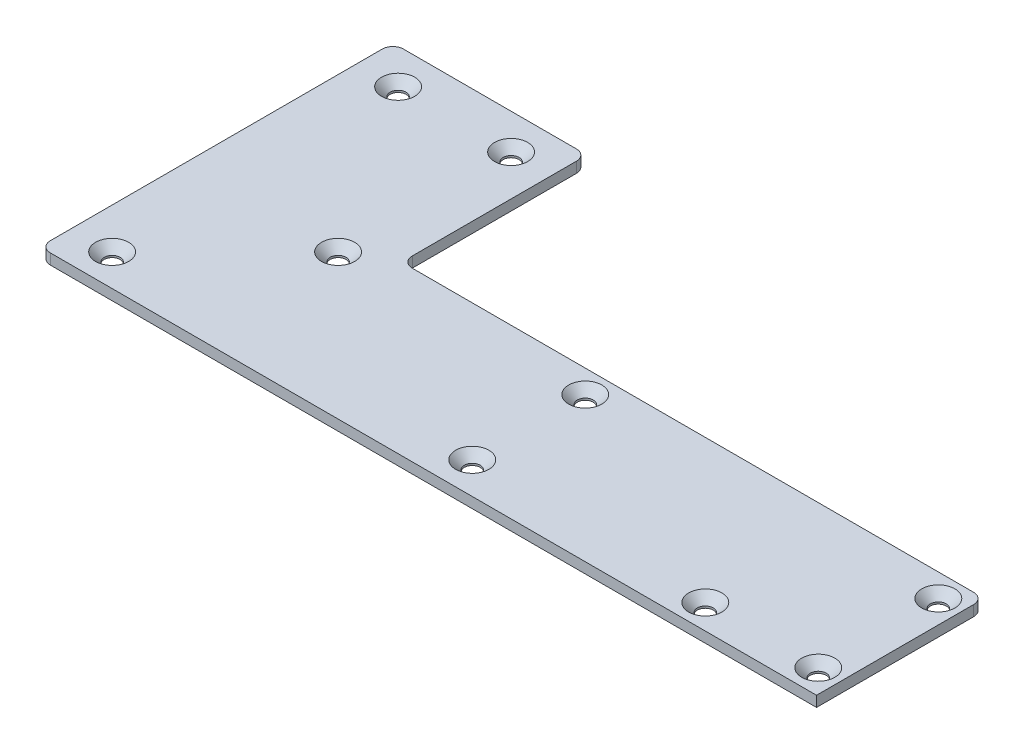
ISO-10303-21;
HEADER;
FILE_DESCRIPTION(('STEP AP214'),'2;1');
FILE_NAME('part.step','',(''),(''),'','','');
FILE_SCHEMA(('AUTOMOTIVE_DESIGN { 1 0 10303 214 1 1 1 1 }'));
ENDSEC;
DATA;
#1=APPLICATION_CONTEXT('core data for automotive mechanical design processes');
#2=APPLICATION_PROTOCOL_DEFINITION('international standard','automotive_design',2000,#1);
#3=PRODUCT_CONTEXT('',#1,'mechanical');
#4=PRODUCT('Part','Part','',(#3));
#5=PRODUCT_RELATED_PRODUCT_CATEGORY('part','',(#4));
#6=PRODUCT_DEFINITION_FORMATION('','',#4);
#7=PRODUCT_DEFINITION_CONTEXT('part definition',#1,'design');
#8=PRODUCT_DEFINITION('design','',#6,#7);
#9=PRODUCT_DEFINITION_SHAPE('','',#8);
#10=(LENGTH_UNIT() NAMED_UNIT(*) SI_UNIT(.MILLI.,.METRE.));
#11=(NAMED_UNIT(*) PLANE_ANGLE_UNIT() SI_UNIT($,.RADIAN.));
#12=(NAMED_UNIT(*) SI_UNIT($,.STERADIAN.) SOLID_ANGLE_UNIT());
#13=UNCERTAINTY_MEASURE_WITH_UNIT(LENGTH_MEASURE(1.E-05),#10,'distance_accuracy_value','');
#14=(GEOMETRIC_REPRESENTATION_CONTEXT(3) GLOBAL_UNCERTAINTY_ASSIGNED_CONTEXT((#13)) GLOBAL_UNIT_ASSIGNED_CONTEXT((#10,
#11,#12)) REPRESENTATION_CONTEXT('',''));
#15=CARTESIAN_POINT('',(0.,0.,0.));
#16=DIRECTION('',(0.,0.,1.));
#17=DIRECTION('',(1.,0.,0.));
#18=AXIS2_PLACEMENT_3D('',#15,#16,#17);
#19=CARTESIAN_POINT('',(0.,3.,-100.));
#20=DIRECTION('',(1.,0.,0.));
#21=DIRECTION('',(0.,0.,-1.));
#22=AXIS2_PLACEMENT_3D('',#19,#20,#21);
#23=PLANE('',#22);
#24=DIRECTION('',(0.,0.,1.));
#25=VECTOR('',#24,1.);
#26=CARTESIAN_POINT('',(0.,0.,-100.));
#27=LINE('',#26,#25);
#28=CARTESIAN_POINT('',(0.,0.,-97.));
#29=VERTEX_POINT('',#28);
#30=CARTESIAN_POINT('',(0.,0.,-3.));
#31=VERTEX_POINT('',#30);
#32=EDGE_CURVE('E155',#29,#31,#27,.T.);
#33=ORIENTED_EDGE('',*,*,#32,.T.);
#34=DIRECTION('',(0.,-1.,0.));
#35=VECTOR('',#34,1.);
#36=CARTESIAN_POINT('',(0.,3.,-3.));
#37=LINE('',#36,#35);
#38=CARTESIAN_POINT('',(0.,3.,-3.));
#39=VERTEX_POINT('',#38);
#40=EDGE_CURVE('E194',#31,#39,#37,.F.);
#41=ORIENTED_EDGE('',*,*,#40,.T.);
#42=DIRECTION('',(0.,0.,1.));
#43=VECTOR('',#42,1.);
#44=CARTESIAN_POINT('',(0.,3.,-100.));
#45=LINE('',#44,#43);
#46=CARTESIAN_POINT('',(0.,3.,-97.));
#47=VERTEX_POINT('',#46);
#48=EDGE_CURVE('E130',#47,#39,#45,.T.);
#49=ORIENTED_EDGE('',*,*,#48,.F.);
#50=DIRECTION('',(0.,-1.,0.));
#51=VECTOR('',#50,1.);
#52=CARTESIAN_POINT('',(0.,3.,-97.));
#53=LINE('',#52,#51);
#54=EDGE_CURVE('E191',#47,#29,#53,.T.);
#55=ORIENTED_EDGE('',*,*,#54,.T.);
#56=EDGE_LOOP('',(#33,#41,#49,#55));
#57=FACE_BOUND('',#56,.T.);
#58=ADVANCED_FACE('F35',(#57),#23,.F.);
#59=CARTESIAN_POINT('',(0.,3.,0.));
#60=DIRECTION('',(0.,0.,-1.));
#61=DIRECTION('',(-1.,0.,0.));
#62=AXIS2_PLACEMENT_3D('',#59,#60,#61);
#63=PLANE('',#62);
#64=DIRECTION('',(1.,0.,0.));
#65=VECTOR('',#64,1.);
#66=CARTESIAN_POINT('',(0.,3.,0.));
#67=LINE('',#66,#65);
#68=CARTESIAN_POINT('',(3.,3.,0.));
#69=VERTEX_POINT('',#68);
#70=CARTESIAN_POINT('',(219.999999999998,3.,0.));
#71=VERTEX_POINT('',#70);
#72=EDGE_CURVE('E118',#69,#71,#67,.T.);
#73=ORIENTED_EDGE('',*,*,#72,.F.);
#74=DIRECTION('',(0.,-1.,0.));
#75=VECTOR('',#74,1.);
#76=CARTESIAN_POINT('',(3.,3.,0.));
#77=LINE('',#76,#75);
#78=CARTESIAN_POINT('',(3.,0.,0.));
#79=VERTEX_POINT('',#78);
#80=EDGE_CURVE('E189',#69,#79,#77,.T.);
#81=ORIENTED_EDGE('',*,*,#80,.T.);
#82=DIRECTION('',(1.,0.,0.));
#83=VECTOR('',#82,1.);
#84=CARTESIAN_POINT('',(0.,0.,0.));
#85=LINE('',#84,#83);
#86=CARTESIAN_POINT('',(219.999999999998,0.,0.));
#87=VERTEX_POINT('',#86);
#88=EDGE_CURVE('E136',#79,#87,#85,.T.);
#89=ORIENTED_EDGE('',*,*,#88,.T.);
#90=DIRECTION('',(0.,-1.,0.));
#91=VECTOR('',#90,1.);
#92=CARTESIAN_POINT('',(219.999999999998,3.,0.));
#93=LINE('',#92,#91);
#94=EDGE_CURVE('E133',#71,#87,#93,.T.);
#95=ORIENTED_EDGE('',*,*,#94,.F.);
#96=EDGE_LOOP('',(#73,#81,#89,#95));
#97=FACE_BOUND('',#96,.T.);
#98=ADVANCED_FACE('F134',(#97),#63,.F.);
#99=CARTESIAN_POINT('',(219.999999999998,3.,0.));
#100=DIRECTION('',(-1.,0.,0.));
#101=DIRECTION('',(0.,0.,1.));
#102=AXIS2_PLACEMENT_3D('',#99,#100,#101);
#103=PLANE('',#102);
#104=DIRECTION('',(0.,0.,-1.));
#105=VECTOR('',#104,1.);
#106=CARTESIAN_POINT('',(219.999999999998,0.,0.));
#107=LINE('',#106,#105);
#108=CARTESIAN_POINT('',(219.999999999998,0.,-44.4999999999982));
#109=VERTEX_POINT('',#108);
#110=EDGE_CURVE('E160',#87,#109,#107,.T.);
#111=ORIENTED_EDGE('',*,*,#110,.T.);
#112=DIRECTION('',(0.,-1.,0.));
#113=VECTOR('',#112,1.);
#114=CARTESIAN_POINT('',(219.999999999998,3.,-44.4999999999982));
#115=LINE('',#114,#113);
#116=CARTESIAN_POINT('',(219.999999999998,3.,-44.4999999999982));
#117=VERTEX_POINT('',#116);
#118=EDGE_CURVE('E145',#109,#117,#115,.F.);
#119=ORIENTED_EDGE('',*,*,#118,.T.);
#120=DIRECTION('',(0.,0.,-1.));
#121=VECTOR('',#120,1.);
#122=CARTESIAN_POINT('',(219.999999999998,3.,0.));
#123=LINE('',#122,#121);
#124=EDGE_CURVE('E122',#71,#117,#123,.T.);
#125=ORIENTED_EDGE('',*,*,#124,.F.);
#126=ORIENTED_EDGE('',*,*,#94,.T.);
#127=EDGE_LOOP('',(#111,#119,#125,#126));
#128=FACE_BOUND('',#127,.T.);
#129=ADVANCED_FACE('F143',(#128),#103,.F.);
#130=CARTESIAN_POINT('',(219.999999999998,3.,-47.4999999999982));
#131=DIRECTION('',(0.,0.,1.));
#132=DIRECTION('',(1.,0.,0.));
#133=AXIS2_PLACEMENT_3D('',#130,#131,#132);
#134=PLANE('',#133);
#135=DIRECTION('',(-1.,0.,0.));
#136=VECTOR('',#135,1.);
#137=CARTESIAN_POINT('',(219.999999999998,3.,-47.4999999999982));
#138=LINE('',#137,#136);
#139=CARTESIAN_POINT('',(216.999999999998,3.,-47.4999999999982));
#140=VERTEX_POINT('',#139);
#141=CARTESIAN_POINT('',(58.,3.,-47.4999999999982));
#142=VERTEX_POINT('',#141);
#143=EDGE_CURVE('E146',#140,#142,#138,.T.);
#144=ORIENTED_EDGE('',*,*,#143,.F.);
#145=DIRECTION('',(0.,-1.,0.));
#146=VECTOR('',#145,1.);
#147=CARTESIAN_POINT('',(216.999999999998,3.,-47.4999999999982));
#148=LINE('',#147,#146);
#149=CARTESIAN_POINT('',(216.999999999998,0.,-47.4999999999982));
#150=VERTEX_POINT('',#149);
#151=EDGE_CURVE('E171',#140,#150,#148,.T.);
#152=ORIENTED_EDGE('',*,*,#151,.T.);
#153=DIRECTION('',(-1.,0.,0.));
#154=VECTOR('',#153,1.);
#155=CARTESIAN_POINT('',(219.999999999998,0.,-47.4999999999982));
#156=LINE('',#155,#154);
#157=CARTESIAN_POINT('',(58.,0.,-47.4999999999982));
#158=VERTEX_POINT('',#157);
#159=EDGE_CURVE('E162',#150,#158,#156,.T.);
#160=ORIENTED_EDGE('',*,*,#159,.T.);
#161=DIRECTION('',(0.,-1.,0.));
#162=VECTOR('',#161,1.);
#163=CARTESIAN_POINT('',(58.,3.,-47.4999999999982));
#164=LINE('',#163,#162);
#165=EDGE_CURVE('E140',#158,#142,#164,.F.);
#166=ORIENTED_EDGE('',*,*,#165,.T.);
#167=EDGE_LOOP('',(#144,#152,#160,#166));
#168=FACE_BOUND('',#167,.T.);
#169=ADVANCED_FACE('F213',(#168),#134,.F.);
#170=CARTESIAN_POINT('',(55.,3.,-47.4999999999982));
#171=DIRECTION('',(-1.,0.,0.));
#172=DIRECTION('',(0.,0.,1.));
#173=AXIS2_PLACEMENT_3D('',#170,#171,#172);
#174=PLANE('',#173);
#175=DIRECTION('',(0.,0.,-1.));
#176=VECTOR('',#175,1.);
#177=CARTESIAN_POINT('',(55.,3.,-47.4999999999982));
#178=LINE('',#177,#176);
#179=CARTESIAN_POINT('',(55.,3.,-50.4999999999982));
#180=VERTEX_POINT('',#179);
#181=CARTESIAN_POINT('',(55.,3.,-97.));
#182=VERTEX_POINT('',#181);
#183=EDGE_CURVE('E149',#180,#182,#178,.T.);
#184=ORIENTED_EDGE('',*,*,#183,.F.);
#185=DIRECTION('',(0.,-1.,0.));
#186=VECTOR('',#185,1.);
#187=CARTESIAN_POINT('',(55.,0.,-50.4999999999982));
#188=LINE('',#187,#186);
#189=CARTESIAN_POINT('',(55.,0.,-50.4999999999982));
#190=VERTEX_POINT('',#189);
#191=EDGE_CURVE('E202',#180,#190,#188,.T.);
#192=ORIENTED_EDGE('',*,*,#191,.T.);
#193=DIRECTION('',(0.,0.,-1.));
#194=VECTOR('',#193,1.);
#195=CARTESIAN_POINT('',(55.,0.,-47.4999999999982));
#196=LINE('',#195,#194);
#197=CARTESIAN_POINT('',(55.,0.,-97.));
#198=VERTEX_POINT('',#197);
#199=EDGE_CURVE('E165',#190,#198,#196,.T.);
#200=ORIENTED_EDGE('',*,*,#199,.T.);
#201=DIRECTION('',(0.,-1.,0.));
#202=VECTOR('',#201,1.);
#203=CARTESIAN_POINT('',(55.,3.,-97.));
#204=LINE('',#203,#202);
#205=EDGE_CURVE('E200',#198,#182,#204,.F.);
#206=ORIENTED_EDGE('',*,*,#205,.T.);
#207=EDGE_LOOP('',(#184,#192,#200,#206));
#208=FACE_BOUND('',#207,.T.);
#209=ADVANCED_FACE('F219',(#208),#174,.F.);
#210=CARTESIAN_POINT('',(55.,3.,-100.));
#211=DIRECTION('',(0.,0.,1.));
#212=DIRECTION('',(1.,0.,0.));
#213=AXIS2_PLACEMENT_3D('',#210,#211,#212);
#214=PLANE('',#213);
#215=DIRECTION('',(-1.,0.,0.));
#216=VECTOR('',#215,1.);
#217=CARTESIAN_POINT('',(55.,0.,-100.));
#218=LINE('',#217,#216);
#219=CARTESIAN_POINT('',(52.,0.,-100.));
#220=VERTEX_POINT('',#219);
#221=CARTESIAN_POINT('',(2.99999999999999,0.,-100.));
#222=VERTEX_POINT('',#221);
#223=EDGE_CURVE('E168',#220,#222,#218,.T.);
#224=ORIENTED_EDGE('',*,*,#223,.T.);
#225=DIRECTION('',(0.,-1.,0.));
#226=VECTOR('',#225,1.);
#227=CARTESIAN_POINT('',(2.99999999999999,3.,-100.));
#228=LINE('',#227,#226);
#229=CARTESIAN_POINT('',(2.99999999999999,3.,-100.));
#230=VERTEX_POINT('',#229);
#231=EDGE_CURVE('E50',#222,#230,#228,.F.);
#232=ORIENTED_EDGE('',*,*,#231,.T.);
#233=DIRECTION('',(-1.,0.,0.));
#234=VECTOR('',#233,1.);
#235=CARTESIAN_POINT('',(55.,3.,-100.));
#236=LINE('',#235,#234);
#237=CARTESIAN_POINT('',(52.,3.,-100.));
#238=VERTEX_POINT('',#237);
#239=EDGE_CURVE('E141',#238,#230,#236,.T.);
#240=ORIENTED_EDGE('',*,*,#239,.F.);
#241=DIRECTION('',(0.,-1.,0.));
#242=VECTOR('',#241,1.);
#243=CARTESIAN_POINT('',(52.,3.,-100.));
#244=LINE('',#243,#242);
#245=EDGE_CURVE('E196',#238,#220,#244,.T.);
#246=ORIENTED_EDGE('',*,*,#245,.T.);
#247=EDGE_LOOP('',(#224,#232,#240,#246));
#248=FACE_BOUND('',#247,.T.);
#249=ADVANCED_FACE('F224',(#248),#214,.F.);
#250=CARTESIAN_POINT('',(0.,3.,0.));
#251=DIRECTION('',(0.,1.,0.));
#252=DIRECTION('',(0.,0.,1.));
#253=AXIS2_PLACEMENT_3D('',#250,#251,#252);
#254=PLANE('',#253);
#255=CARTESIAN_POINT('',(11.4999999999993,3.,-89.9999999999987));
#256=DIRECTION('',(0.,1.,0.));
#257=DIRECTION('',(0.,0.,1.));
#258=AXIS2_PLACEMENT_3D('',#255,#256,#257);
#259=CIRCLE('',#258,4.7);
#260=CARTESIAN_POINT('',(11.4999999999993,3.,-85.2999999999987));
#261=VERTEX_POINT('',#260);
#262=EDGE_CURVE('E311',#261,#261,#259,.T.);
#263=ORIENTED_EDGE('',*,*,#262,.F.);
#264=EDGE_LOOP('',(#263));
#265=FACE_BOUND('',#264,.T.);
#266=CARTESIAN_POINT('',(11.4999999999985,3.,-8.99999999999867));
#267=DIRECTION('',(0.,1.,0.));
#268=DIRECTION('',(0.,0.,1.));
#269=AXIS2_PLACEMENT_3D('',#266,#267,#268);
#270=CIRCLE('',#269,4.7);
#271=CARTESIAN_POINT('',(11.4999999999985,3.,-4.29999999999868));
#272=VERTEX_POINT('',#271);
#273=EDGE_CURVE('E302',#272,#272,#270,.T.);
#274=ORIENTED_EDGE('',*,*,#273,.F.);
#275=EDGE_LOOP('',(#274));
#276=FACE_BOUND('',#275,.T.);
#277=CARTESIAN_POINT('',(43.4999999999988,3.,-40.9999999999983));
#278=DIRECTION('',(0.,1.,0.));
#279=DIRECTION('',(0.,0.,1.));
#280=AXIS2_PLACEMENT_3D('',#277,#278,#279);
#281=CIRCLE('',#280,4.7);
#282=CARTESIAN_POINT('',(43.4999999999988,3.,-36.2999999999983));
#283=VERTEX_POINT('',#282);
#284=EDGE_CURVE('E293',#283,#283,#281,.T.);
#285=ORIENTED_EDGE('',*,*,#284,.F.);
#286=EDGE_LOOP('',(#285));
#287=FACE_BOUND('',#286,.T.);
#288=CARTESIAN_POINT('',(43.4999999999993,3.,-89.9999999999983));
#289=DIRECTION('',(0.,1.,0.));
#290=DIRECTION('',(0.,0.,1.));
#291=AXIS2_PLACEMENT_3D('',#288,#289,#290);
#292=CIRCLE('',#291,4.7);
#293=CARTESIAN_POINT('',(43.4999999999993,3.,-85.2999999999983));
#294=VERTEX_POINT('',#293);
#295=EDGE_CURVE('E284',#294,#294,#292,.T.);
#296=ORIENTED_EDGE('',*,*,#295,.F.);
#297=EDGE_LOOP('',(#296));
#298=FACE_BOUND('',#297,.T.);
#299=CARTESIAN_POINT('',(113.499999999999,3.,-40.9999999999976));
#300=DIRECTION('',(0.,1.,0.));
#301=DIRECTION('',(0.,0.,1.));
#302=AXIS2_PLACEMENT_3D('',#299,#300,#301);
#303=CIRCLE('',#302,4.7);
#304=CARTESIAN_POINT('',(113.499999999999,3.,-36.2999999999976));
#305=VERTEX_POINT('',#304);
#306=EDGE_CURVE('E275',#305,#305,#303,.T.);
#307=ORIENTED_EDGE('',*,*,#306,.F.);
#308=EDGE_LOOP('',(#307));
#309=FACE_BOUND('',#308,.T.);
#310=CARTESIAN_POINT('',(113.499999999999,3.,-8.99999999999762));
#311=DIRECTION('',(0.,1.,0.));
#312=DIRECTION('',(0.,0.,1.));
#313=AXIS2_PLACEMENT_3D('',#310,#311,#312);
#314=CIRCLE('',#313,4.7);
#315=CARTESIAN_POINT('',(113.499999999999,3.,-4.29999999999762));
#316=VERTEX_POINT('',#315);
#317=EDGE_CURVE('E266',#316,#316,#314,.T.);
#318=ORIENTED_EDGE('',*,*,#317,.F.);
#319=EDGE_LOOP('',(#318));
#320=FACE_BOUND('',#319,.T.);
#321=CARTESIAN_POINT('',(181.499999999998,3.,-6.9999999999969));
#322=DIRECTION('',(0.,1.,0.));
#323=DIRECTION('',(0.,0.,1.));
#324=AXIS2_PLACEMENT_3D('',#321,#322,#323);
#325=CIRCLE('',#324,4.70000000000001);
#326=CARTESIAN_POINT('',(181.499999999998,3.,-2.29999999999689));
#327=VERTEX_POINT('',#326);
#328=EDGE_CURVE('E257',#327,#327,#325,.T.);
#329=ORIENTED_EDGE('',*,*,#328,.F.);
#330=EDGE_LOOP('',(#329));
#331=FACE_BOUND('',#330,.T.);
#332=CARTESIAN_POINT('',(213.499999999998,3.,-6.99999999999656));
#333=DIRECTION('',(0.,1.,0.));
#334=DIRECTION('',(0.,0.,1.));
#335=AXIS2_PLACEMENT_3D('',#332,#333,#334);
#336=CIRCLE('',#335,4.70000000000001);
#337=CARTESIAN_POINT('',(213.499999999998,3.,-2.29999999999655));
#338=VERTEX_POINT('',#337);
#339=EDGE_CURVE('E248',#338,#338,#336,.T.);
#340=ORIENTED_EDGE('',*,*,#339,.F.);
#341=EDGE_LOOP('',(#340));
#342=FACE_BOUND('',#341,.T.);
#343=CARTESIAN_POINT('',(213.499999999999,3.,-40.9999999999966));
#344=DIRECTION('',(0.,1.,0.));
#345=DIRECTION('',(0.,0.,1.));
#346=AXIS2_PLACEMENT_3D('',#343,#344,#345);
#347=CIRCLE('',#346,4.70000000000001);
#348=CARTESIAN_POINT('',(213.499999999999,3.,-36.2999999999966));
#349=VERTEX_POINT('',#348);
#350=EDGE_CURVE('E239',#349,#349,#347,.T.);
#351=ORIENTED_EDGE('',*,*,#350,.F.);
#352=EDGE_LOOP('',(#351));
#353=FACE_BOUND('',#352,.T.);
#354=ORIENTED_EDGE('',*,*,#124,.T.);
#355=CARTESIAN_POINT('',(216.999999999998,3.,-44.4999999999982));
#356=DIRECTION('',(0.,1.,0.));
#357=DIRECTION('',(0.,0.,1.));
#358=AXIS2_PLACEMENT_3D('',#355,#356,#357);
#359=CIRCLE('',#358,3.);
#360=EDGE_CURVE('E187',#117,#140,#359,.T.);
#361=ORIENTED_EDGE('',*,*,#360,.T.);
#362=ORIENTED_EDGE('',*,*,#143,.T.);
#363=CARTESIAN_POINT('',(58.,3.,-50.4999999999982));
#364=DIRECTION('',(0.,1.,0.));
#365=DIRECTION('',(0.,0.,1.));
#366=AXIS2_PLACEMENT_3D('',#363,#364,#365);
#367=CIRCLE('',#366,3.);
#368=EDGE_CURVE('E11',#142,#180,#367,.F.);
#369=ORIENTED_EDGE('',*,*,#368,.T.);
#370=ORIENTED_EDGE('',*,*,#183,.T.);
#371=CARTESIAN_POINT('',(52.,3.,-97.));
#372=DIRECTION('',(0.,1.,0.));
#373=DIRECTION('',(0.,0.,1.));
#374=AXIS2_PLACEMENT_3D('',#371,#372,#373);
#375=CIRCLE('',#374,3.);
#376=EDGE_CURVE('E57',#182,#238,#375,.T.);
#377=ORIENTED_EDGE('',*,*,#376,.T.);
#378=ORIENTED_EDGE('',*,*,#239,.T.);
#379=CARTESIAN_POINT('',(2.99999999999999,3.,-97.));
#380=DIRECTION('',(0.,1.,0.));
#381=DIRECTION('',(0.,0.,1.));
#382=AXIS2_PLACEMENT_3D('',#379,#380,#381);
#383=CIRCLE('',#382,3.);
#384=EDGE_CURVE('E184',#230,#47,#383,.T.);
#385=ORIENTED_EDGE('',*,*,#384,.T.);
#386=ORIENTED_EDGE('',*,*,#48,.T.);
#387=CARTESIAN_POINT('',(3.,3.,-3.));
#388=DIRECTION('',(0.,1.,0.));
#389=DIRECTION('',(0.,0.,1.));
#390=AXIS2_PLACEMENT_3D('',#387,#388,#389);
#391=CIRCLE('',#390,3.);
#392=EDGE_CURVE('E126',#39,#69,#391,.T.);
#393=ORIENTED_EDGE('',*,*,#392,.T.);
#394=ORIENTED_EDGE('',*,*,#72,.T.);
#395=EDGE_LOOP('',(#354,#361,#362,#369,#370,#377,#378,#385,#386,#393,#394));
#396=FACE_BOUND('',#395,.T.);
#397=ADVANCED_FACE('F120',(#265,#276,#287,#298,#309,#320,#331,#342,#353,#396),#254,.T.);
#398=CARTESIAN_POINT('',(0.,0.,0.));
#399=DIRECTION('',(0.,1.,0.));
#400=DIRECTION('',(0.,0.,1.));
#401=AXIS2_PLACEMENT_3D('',#398,#399,#400);
#402=PLANE('',#401);
#403=CARTESIAN_POINT('',(11.4999999999993,0.,-89.9999999999987));
#404=DIRECTION('',(0.,1.,0.));
#405=DIRECTION('',(0.,0.,1.));
#406=AXIS2_PLACEMENT_3D('',#403,#404,#405);
#407=CIRCLE('',#406,2.25);
#408=CARTESIAN_POINT('',(11.4999999999993,0.,-87.7499999999987));
#409=VERTEX_POINT('',#408);
#410=EDGE_CURVE('E305',#409,#409,#407,.T.);
#411=ORIENTED_EDGE('',*,*,#410,.T.);
#412=EDGE_LOOP('',(#411));
#413=FACE_BOUND('',#412,.T.);
#414=CARTESIAN_POINT('',(11.4999999999985,0.,-8.99999999999867));
#415=DIRECTION('',(0.,1.,0.));
#416=DIRECTION('',(0.,0.,1.));
#417=AXIS2_PLACEMENT_3D('',#414,#415,#416);
#418=CIRCLE('',#417,2.25);
#419=CARTESIAN_POINT('',(11.4999999999985,0.,-6.74999999999868));
#420=VERTEX_POINT('',#419);
#421=EDGE_CURVE('E296',#420,#420,#418,.T.);
#422=ORIENTED_EDGE('',*,*,#421,.T.);
#423=EDGE_LOOP('',(#422));
#424=FACE_BOUND('',#423,.T.);
#425=CARTESIAN_POINT('',(43.4999999999988,0.,-40.9999999999983));
#426=DIRECTION('',(0.,1.,0.));
#427=DIRECTION('',(0.,0.,1.));
#428=AXIS2_PLACEMENT_3D('',#425,#426,#427);
#429=CIRCLE('',#428,2.25);
#430=CARTESIAN_POINT('',(43.4999999999988,0.,-38.7499999999983));
#431=VERTEX_POINT('',#430);
#432=EDGE_CURVE('E287',#431,#431,#429,.T.);
#433=ORIENTED_EDGE('',*,*,#432,.T.);
#434=EDGE_LOOP('',(#433));
#435=FACE_BOUND('',#434,.T.);
#436=CARTESIAN_POINT('',(43.4999999999993,0.,-89.9999999999983));
#437=DIRECTION('',(0.,1.,0.));
#438=DIRECTION('',(0.,0.,1.));
#439=AXIS2_PLACEMENT_3D('',#436,#437,#438);
#440=CIRCLE('',#439,2.25);
#441=CARTESIAN_POINT('',(43.4999999999993,0.,-87.7499999999983));
#442=VERTEX_POINT('',#441);
#443=EDGE_CURVE('E278',#442,#442,#440,.T.);
#444=ORIENTED_EDGE('',*,*,#443,.T.);
#445=EDGE_LOOP('',(#444));
#446=FACE_BOUND('',#445,.T.);
#447=CARTESIAN_POINT('',(113.499999999999,0.,-40.9999999999976));
#448=DIRECTION('',(0.,1.,0.));
#449=DIRECTION('',(0.,0.,1.));
#450=AXIS2_PLACEMENT_3D('',#447,#448,#449);
#451=CIRCLE('',#450,2.25);
#452=CARTESIAN_POINT('',(113.499999999999,0.,-38.7499999999976));
#453=VERTEX_POINT('',#452);
#454=EDGE_CURVE('E269',#453,#453,#451,.T.);
#455=ORIENTED_EDGE('',*,*,#454,.T.);
#456=EDGE_LOOP('',(#455));
#457=FACE_BOUND('',#456,.T.);
#458=CARTESIAN_POINT('',(113.499999999999,0.,-8.99999999999762));
#459=DIRECTION('',(0.,1.,0.));
#460=DIRECTION('',(0.,0.,1.));
#461=AXIS2_PLACEMENT_3D('',#458,#459,#460);
#462=CIRCLE('',#461,2.25);
#463=CARTESIAN_POINT('',(113.499999999999,0.,-6.74999999999762));
#464=VERTEX_POINT('',#463);
#465=EDGE_CURVE('E260',#464,#464,#462,.T.);
#466=ORIENTED_EDGE('',*,*,#465,.T.);
#467=EDGE_LOOP('',(#466));
#468=FACE_BOUND('',#467,.T.);
#469=CARTESIAN_POINT('',(181.499999999998,0.,-6.9999999999969));
#470=DIRECTION('',(0.,1.,0.));
#471=DIRECTION('',(0.,0.,1.));
#472=AXIS2_PLACEMENT_3D('',#469,#470,#471);
#473=CIRCLE('',#472,2.25);
#474=CARTESIAN_POINT('',(181.499999999998,0.,-4.7499999999969));
#475=VERTEX_POINT('',#474);
#476=EDGE_CURVE('E251',#475,#475,#473,.T.);
#477=ORIENTED_EDGE('',*,*,#476,.T.);
#478=EDGE_LOOP('',(#477));
#479=FACE_BOUND('',#478,.T.);
#480=CARTESIAN_POINT('',(213.499999999998,0.,-6.99999999999656));
#481=DIRECTION('',(0.,1.,0.));
#482=DIRECTION('',(0.,0.,1.));
#483=AXIS2_PLACEMENT_3D('',#480,#481,#482);
#484=CIRCLE('',#483,2.25);
#485=CARTESIAN_POINT('',(213.499999999998,0.,-4.74999999999656));
#486=VERTEX_POINT('',#485);
#487=EDGE_CURVE('E242',#486,#486,#484,.T.);
#488=ORIENTED_EDGE('',*,*,#487,.T.);
#489=EDGE_LOOP('',(#488));
#490=FACE_BOUND('',#489,.T.);
#491=CARTESIAN_POINT('',(213.499999999999,0.,-40.9999999999966));
#492=DIRECTION('',(0.,1.,0.));
#493=DIRECTION('',(0.,0.,1.));
#494=AXIS2_PLACEMENT_3D('',#491,#492,#493);
#495=CIRCLE('',#494,2.25);
#496=CARTESIAN_POINT('',(213.499999999999,0.,-38.7499999999966));
#497=VERTEX_POINT('',#496);
#498=EDGE_CURVE('E158',#497,#497,#495,.T.);
#499=ORIENTED_EDGE('',*,*,#498,.T.);
#500=EDGE_LOOP('',(#499));
#501=FACE_BOUND('',#500,.T.);
#502=ORIENTED_EDGE('',*,*,#159,.F.);
#503=CARTESIAN_POINT('',(216.999999999998,0.,-44.4999999999982));
#504=DIRECTION('',(0.,1.,0.));
#505=DIRECTION('',(0.,0.,1.));
#506=AXIS2_PLACEMENT_3D('',#503,#504,#505);
#507=CIRCLE('',#506,3.);
#508=EDGE_CURVE('E180',#150,#109,#507,.F.);
#509=ORIENTED_EDGE('',*,*,#508,.T.);
#510=ORIENTED_EDGE('',*,*,#110,.F.);
#511=ORIENTED_EDGE('',*,*,#88,.F.);
#512=CARTESIAN_POINT('',(3.,0.,-3.));
#513=DIRECTION('',(0.,1.,0.));
#514=DIRECTION('',(0.,0.,1.));
#515=AXIS2_PLACEMENT_3D('',#512,#513,#514);
#516=CIRCLE('',#515,3.);
#517=EDGE_CURVE('E178',#79,#31,#516,.F.);
#518=ORIENTED_EDGE('',*,*,#517,.T.);
#519=ORIENTED_EDGE('',*,*,#32,.F.);
#520=CARTESIAN_POINT('',(2.99999999999999,0.,-97.));
#521=DIRECTION('',(0.,1.,0.));
#522=DIRECTION('',(0.,0.,1.));
#523=AXIS2_PLACEMENT_3D('',#520,#521,#522);
#524=CIRCLE('',#523,3.);
#525=EDGE_CURVE('E176',#29,#222,#524,.F.);
#526=ORIENTED_EDGE('',*,*,#525,.T.);
#527=ORIENTED_EDGE('',*,*,#223,.F.);
#528=CARTESIAN_POINT('',(52.,0.,-97.));
#529=DIRECTION('',(0.,1.,0.));
#530=DIRECTION('',(0.,0.,1.));
#531=AXIS2_PLACEMENT_3D('',#528,#529,#530);
#532=CIRCLE('',#531,3.);
#533=EDGE_CURVE('E174',#220,#198,#532,.F.);
#534=ORIENTED_EDGE('',*,*,#533,.T.);
#535=ORIENTED_EDGE('',*,*,#199,.F.);
#536=CARTESIAN_POINT('',(58.,0.,-50.4999999999982));
#537=DIRECTION('',(0.,1.,0.));
#538=DIRECTION('',(0.,0.,1.));
#539=AXIS2_PLACEMENT_3D('',#536,#537,#538);
#540=CIRCLE('',#539,3.);
#541=EDGE_CURVE('E43',#190,#158,#540,.T.);
#542=ORIENTED_EDGE('',*,*,#541,.T.);
#543=EDGE_LOOP('',(#502,#509,#510,#511,#518,#519,#526,#527,#534,#535,#542));
#544=FACE_BOUND('',#543,.T.);
#545=ADVANCED_FACE('F207',(#413,#424,#435,#446,#457,#468,#479,#490,#501,#544),#402,.F.);
#546=CARTESIAN_POINT('',(213.499999999999,3.,-40.9999999999966));
#547=DIRECTION('',(0.,1.,0.));
#548=DIRECTION('',(0.,0.,1.));
#549=AXIS2_PLACEMENT_3D('',#546,#547,#548);
#550=CYLINDRICAL_SURFACE('',#549,2.25);
#551=ORIENTED_EDGE('',*,*,#498,.F.);
#552=EDGE_LOOP('',(#551));
#553=FACE_BOUND('',#552,.T.);
#554=CARTESIAN_POINT('',(213.499999999999,0.549999999999999,-40.9999999999966));
#555=DIRECTION('',(0.,1.,0.));
#556=DIRECTION('',(0.,0.,1.));
#557=AXIS2_PLACEMENT_3D('',#554,#555,#556);
#558=CIRCLE('',#557,2.25);
#559=CARTESIAN_POINT('',(213.499999999999,0.549999999999999,-38.7499999999966));
#560=VERTEX_POINT('',#559);
#561=EDGE_CURVE('E236',#560,#560,#558,.T.);
#562=ORIENTED_EDGE('',*,*,#561,.T.);
#563=EDGE_LOOP('',(#562));
#564=FACE_BOUND('',#563,.T.);
#565=ADVANCED_FACE('F339',(#553,#564),#550,.F.);
#566=CARTESIAN_POINT('',(213.499999999999,3.,-40.9999999999966));
#567=DIRECTION('',(0.,1.,0.));
#568=DIRECTION('',(0.,0.,1.));
#569=AXIS2_PLACEMENT_3D('',#566,#567,#568);
#570=CONICAL_SURFACE('',#569,4.70000000000001,0.78539816339745);
#571=ORIENTED_EDGE('',*,*,#561,.F.);
#572=EDGE_LOOP('',(#571));
#573=FACE_BOUND('',#572,.T.);
#574=ORIENTED_EDGE('',*,*,#350,.T.);
#575=EDGE_LOOP('',(#574));
#576=FACE_BOUND('',#575,.T.);
#577=ADVANCED_FACE('F336',(#573,#576),#570,.F.);
#578=CARTESIAN_POINT('',(213.499999999998,3.,-6.99999999999656));
#579=DIRECTION('',(0.,1.,0.));
#580=DIRECTION('',(0.,0.,1.));
#581=AXIS2_PLACEMENT_3D('',#578,#579,#580);
#582=CYLINDRICAL_SURFACE('',#581,2.25);
#583=ORIENTED_EDGE('',*,*,#487,.F.);
#584=EDGE_LOOP('',(#583));
#585=FACE_BOUND('',#584,.T.);
#586=CARTESIAN_POINT('',(213.499999999998,0.549999999999999,-6.99999999999656));
#587=DIRECTION('',(0.,1.,0.));
#588=DIRECTION('',(0.,0.,1.));
#589=AXIS2_PLACEMENT_3D('',#586,#587,#588);
#590=CIRCLE('',#589,2.25);
#591=CARTESIAN_POINT('',(213.499999999998,0.549999999999999,-4.74999999999656));
#592=VERTEX_POINT('',#591);
#593=EDGE_CURVE('E245',#592,#592,#590,.T.);
#594=ORIENTED_EDGE('',*,*,#593,.T.);
#595=EDGE_LOOP('',(#594));
#596=FACE_BOUND('',#595,.T.);
#597=ADVANCED_FACE('F338',(#585,#596),#582,.F.);
#598=CARTESIAN_POINT('',(213.499999999998,3.,-6.99999999999656));
#599=DIRECTION('',(0.,1.,0.));
#600=DIRECTION('',(0.,0.,1.));
#601=AXIS2_PLACEMENT_3D('',#598,#599,#600);
#602=CONICAL_SURFACE('',#601,4.70000000000001,0.78539816339745);
#603=ORIENTED_EDGE('',*,*,#593,.F.);
#604=EDGE_LOOP('',(#603));
#605=FACE_BOUND('',#604,.T.);
#606=ORIENTED_EDGE('',*,*,#339,.T.);
#607=EDGE_LOOP('',(#606));
#608=FACE_BOUND('',#607,.T.);
#609=ADVANCED_FACE('F346',(#605,#608),#602,.F.);
#610=CARTESIAN_POINT('',(181.499999999998,3.,-6.9999999999969));
#611=DIRECTION('',(0.,1.,0.));
#612=DIRECTION('',(0.,0.,1.));
#613=AXIS2_PLACEMENT_3D('',#610,#611,#612);
#614=CYLINDRICAL_SURFACE('',#613,2.25);
#615=ORIENTED_EDGE('',*,*,#476,.F.);
#616=EDGE_LOOP('',(#615));
#617=FACE_BOUND('',#616,.T.);
#618=CARTESIAN_POINT('',(181.499999999998,0.549999999999999,-6.9999999999969));
#619=DIRECTION('',(0.,1.,0.));
#620=DIRECTION('',(0.,0.,1.));
#621=AXIS2_PLACEMENT_3D('',#618,#619,#620);
#622=CIRCLE('',#621,2.25);
#623=CARTESIAN_POINT('',(181.499999999998,0.549999999999999,-4.7499999999969));
#624=VERTEX_POINT('',#623);
#625=EDGE_CURVE('E254',#624,#624,#622,.T.);
#626=ORIENTED_EDGE('',*,*,#625,.T.);
#627=EDGE_LOOP('',(#626));
#628=FACE_BOUND('',#627,.T.);
#629=ADVANCED_FACE('F583',(#617,#628),#614,.F.);
#630=CARTESIAN_POINT('',(181.499999999998,3.,-6.9999999999969));
#631=DIRECTION('',(0.,1.,0.));
#632=DIRECTION('',(0.,0.,1.));
#633=AXIS2_PLACEMENT_3D('',#630,#631,#632);
#634=CONICAL_SURFACE('',#633,4.70000000000001,0.78539816339745);
#635=ORIENTED_EDGE('',*,*,#625,.F.);
#636=EDGE_LOOP('',(#635));
#637=FACE_BOUND('',#636,.T.);
#638=ORIENTED_EDGE('',*,*,#328,.T.);
#639=EDGE_LOOP('',(#638));
#640=FACE_BOUND('',#639,.T.);
#641=ADVANCED_FACE('F573',(#637,#640),#634,.F.);
#642=CARTESIAN_POINT('',(113.499999999999,3.,-8.99999999999762));
#643=DIRECTION('',(0.,1.,0.));
#644=DIRECTION('',(0.,0.,1.));
#645=AXIS2_PLACEMENT_3D('',#642,#643,#644);
#646=CYLINDRICAL_SURFACE('',#645,2.25);
#647=ORIENTED_EDGE('',*,*,#465,.F.);
#648=EDGE_LOOP('',(#647));
#649=FACE_BOUND('',#648,.T.);
#650=CARTESIAN_POINT('',(113.499999999999,0.549999999999999,-8.99999999999762));
#651=DIRECTION('',(0.,1.,0.));
#652=DIRECTION('',(0.,0.,1.));
#653=AXIS2_PLACEMENT_3D('',#650,#651,#652);
#654=CIRCLE('',#653,2.25);
#655=CARTESIAN_POINT('',(113.499999999999,0.549999999999999,-6.74999999999762));
#656=VERTEX_POINT('',#655);
#657=EDGE_CURVE('E263',#656,#656,#654,.T.);
#658=ORIENTED_EDGE('',*,*,#657,.T.);
#659=EDGE_LOOP('',(#658));
#660=FACE_BOUND('',#659,.T.);
#661=ADVANCED_FACE('F563',(#649,#660),#646,.F.);
#662=CARTESIAN_POINT('',(113.499999999999,3.,-8.99999999999762));
#663=DIRECTION('',(0.,1.,0.));
#664=DIRECTION('',(0.,0.,1.));
#665=AXIS2_PLACEMENT_3D('',#662,#663,#664);
#666=CONICAL_SURFACE('',#665,4.7,0.785398163397447);
#667=ORIENTED_EDGE('',*,*,#657,.F.);
#668=EDGE_LOOP('',(#667));
#669=FACE_BOUND('',#668,.T.);
#670=ORIENTED_EDGE('',*,*,#317,.T.);
#671=EDGE_LOOP('',(#670));
#672=FACE_BOUND('',#671,.T.);
#673=ADVANCED_FACE('F553',(#669,#672),#666,.F.);
#674=CARTESIAN_POINT('',(113.499999999999,3.,-40.9999999999976));
#675=DIRECTION('',(0.,1.,0.));
#676=DIRECTION('',(0.,0.,1.));
#677=AXIS2_PLACEMENT_3D('',#674,#675,#676);
#678=CYLINDRICAL_SURFACE('',#677,2.25);
#679=ORIENTED_EDGE('',*,*,#454,.F.);
#680=EDGE_LOOP('',(#679));
#681=FACE_BOUND('',#680,.T.);
#682=CARTESIAN_POINT('',(113.499999999999,0.549999999999999,-40.9999999999976));
#683=DIRECTION('',(0.,1.,0.));
#684=DIRECTION('',(0.,0.,1.));
#685=AXIS2_PLACEMENT_3D('',#682,#683,#684);
#686=CIRCLE('',#685,2.25);
#687=CARTESIAN_POINT('',(113.499999999999,0.549999999999999,-38.7499999999976));
#688=VERTEX_POINT('',#687);
#689=EDGE_CURVE('E272',#688,#688,#686,.T.);
#690=ORIENTED_EDGE('',*,*,#689,.T.);
#691=EDGE_LOOP('',(#690));
#692=FACE_BOUND('',#691,.T.);
#693=ADVANCED_FACE('F543',(#681,#692),#678,.F.);
#694=CARTESIAN_POINT('',(113.499999999999,3.,-40.9999999999976));
#695=DIRECTION('',(0.,1.,0.));
#696=DIRECTION('',(0.,0.,1.));
#697=AXIS2_PLACEMENT_3D('',#694,#695,#696);
#698=CONICAL_SURFACE('',#697,4.7,0.785398163397447);
#699=ORIENTED_EDGE('',*,*,#689,.F.);
#700=EDGE_LOOP('',(#699));
#701=FACE_BOUND('',#700,.T.);
#702=ORIENTED_EDGE('',*,*,#306,.T.);
#703=EDGE_LOOP('',(#702));
#704=FACE_BOUND('',#703,.T.);
#705=ADVANCED_FACE('F533',(#701,#704),#698,.F.);
#706=CARTESIAN_POINT('',(43.4999999999993,3.,-89.9999999999983));
#707=DIRECTION('',(0.,1.,0.));
#708=DIRECTION('',(0.,0.,1.));
#709=AXIS2_PLACEMENT_3D('',#706,#707,#708);
#710=CYLINDRICAL_SURFACE('',#709,2.25);
#711=ORIENTED_EDGE('',*,*,#443,.F.);
#712=EDGE_LOOP('',(#711));
#713=FACE_BOUND('',#712,.T.);
#714=CARTESIAN_POINT('',(43.4999999999993,0.549999999999999,-89.9999999999983));
#715=DIRECTION('',(0.,1.,0.));
#716=DIRECTION('',(0.,0.,1.));
#717=AXIS2_PLACEMENT_3D('',#714,#715,#716);
#718=CIRCLE('',#717,2.25);
#719=CARTESIAN_POINT('',(43.4999999999993,0.549999999999999,-87.7499999999983));
#720=VERTEX_POINT('',#719);
#721=EDGE_CURVE('E281',#720,#720,#718,.T.);
#722=ORIENTED_EDGE('',*,*,#721,.T.);
#723=EDGE_LOOP('',(#722));
#724=FACE_BOUND('',#723,.T.);
#725=ADVANCED_FACE('F523',(#713,#724),#710,.F.);
#726=CARTESIAN_POINT('',(43.4999999999993,3.,-89.9999999999983));
#727=DIRECTION('',(0.,1.,0.));
#728=DIRECTION('',(0.,0.,1.));
#729=AXIS2_PLACEMENT_3D('',#726,#727,#728);
#730=CONICAL_SURFACE('',#729,4.7,0.785398163397448);
#731=ORIENTED_EDGE('',*,*,#721,.F.);
#732=EDGE_LOOP('',(#731));
#733=FACE_BOUND('',#732,.T.);
#734=ORIENTED_EDGE('',*,*,#295,.T.);
#735=EDGE_LOOP('',(#734));
#736=FACE_BOUND('',#735,.T.);
#737=ADVANCED_FACE('F513',(#733,#736),#730,.F.);
#738=CARTESIAN_POINT('',(43.4999999999988,3.,-40.9999999999983));
#739=DIRECTION('',(0.,1.,0.));
#740=DIRECTION('',(0.,0.,1.));
#741=AXIS2_PLACEMENT_3D('',#738,#739,#740);
#742=CYLINDRICAL_SURFACE('',#741,2.25);
#743=ORIENTED_EDGE('',*,*,#432,.F.);
#744=EDGE_LOOP('',(#743));
#745=FACE_BOUND('',#744,.T.);
#746=CARTESIAN_POINT('',(43.4999999999988,0.549999999999999,-40.9999999999983));
#747=DIRECTION('',(0.,1.,0.));
#748=DIRECTION('',(0.,0.,1.));
#749=AXIS2_PLACEMENT_3D('',#746,#747,#748);
#750=CIRCLE('',#749,2.25);
#751=CARTESIAN_POINT('',(43.4999999999988,0.549999999999999,-38.7499999999983));
#752=VERTEX_POINT('',#751);
#753=EDGE_CURVE('E290',#752,#752,#750,.T.);
#754=ORIENTED_EDGE('',*,*,#753,.T.);
#755=EDGE_LOOP('',(#754));
#756=FACE_BOUND('',#755,.T.);
#757=ADVANCED_FACE('F503',(#745,#756),#742,.F.);
#758=CARTESIAN_POINT('',(43.4999999999988,3.,-40.9999999999983));
#759=DIRECTION('',(0.,1.,0.));
#760=DIRECTION('',(0.,0.,1.));
#761=AXIS2_PLACEMENT_3D('',#758,#759,#760);
#762=CONICAL_SURFACE('',#761,4.7,0.785398163397448);
#763=ORIENTED_EDGE('',*,*,#753,.F.);
#764=EDGE_LOOP('',(#763));
#765=FACE_BOUND('',#764,.T.);
#766=ORIENTED_EDGE('',*,*,#284,.T.);
#767=EDGE_LOOP('',(#766));
#768=FACE_BOUND('',#767,.T.);
#769=ADVANCED_FACE('F493',(#765,#768),#762,.F.);
#770=CARTESIAN_POINT('',(11.4999999999985,3.,-8.99999999999867));
#771=DIRECTION('',(0.,1.,0.));
#772=DIRECTION('',(0.,0.,1.));
#773=AXIS2_PLACEMENT_3D('',#770,#771,#772);
#774=CYLINDRICAL_SURFACE('',#773,2.25);
#775=ORIENTED_EDGE('',*,*,#421,.F.);
#776=EDGE_LOOP('',(#775));
#777=FACE_BOUND('',#776,.T.);
#778=CARTESIAN_POINT('',(11.4999999999985,0.549999999999999,-8.99999999999867));
#779=DIRECTION('',(0.,1.,0.));
#780=DIRECTION('',(0.,0.,1.));
#781=AXIS2_PLACEMENT_3D('',#778,#779,#780);
#782=CIRCLE('',#781,2.25);
#783=CARTESIAN_POINT('',(11.4999999999985,0.549999999999999,-6.74999999999868));
#784=VERTEX_POINT('',#783);
#785=EDGE_CURVE('E299',#784,#784,#782,.T.);
#786=ORIENTED_EDGE('',*,*,#785,.T.);
#787=EDGE_LOOP('',(#786));
#788=FACE_BOUND('',#787,.T.);
#789=ADVANCED_FACE('F483',(#777,#788),#774,.F.);
#790=CARTESIAN_POINT('',(11.4999999999985,3.,-8.99999999999867));
#791=DIRECTION('',(0.,1.,0.));
#792=DIRECTION('',(0.,0.,1.));
#793=AXIS2_PLACEMENT_3D('',#790,#791,#792);
#794=CONICAL_SURFACE('',#793,4.7,0.785398163397448);
#795=ORIENTED_EDGE('',*,*,#785,.F.);
#796=EDGE_LOOP('',(#795));
#797=FACE_BOUND('',#796,.T.);
#798=ORIENTED_EDGE('',*,*,#273,.T.);
#799=EDGE_LOOP('',(#798));
#800=FACE_BOUND('',#799,.T.);
#801=ADVANCED_FACE('F473',(#797,#800),#794,.F.);
#802=CARTESIAN_POINT('',(11.4999999999993,3.,-89.9999999999987));
#803=DIRECTION('',(0.,1.,0.));
#804=DIRECTION('',(0.,0.,1.));
#805=AXIS2_PLACEMENT_3D('',#802,#803,#804);
#806=CYLINDRICAL_SURFACE('',#805,2.25);
#807=ORIENTED_EDGE('',*,*,#410,.F.);
#808=EDGE_LOOP('',(#807));
#809=FACE_BOUND('',#808,.T.);
#810=CARTESIAN_POINT('',(11.4999999999993,0.549999999999999,-89.9999999999987));
#811=DIRECTION('',(0.,1.,0.));
#812=DIRECTION('',(0.,0.,1.));
#813=AXIS2_PLACEMENT_3D('',#810,#811,#812);
#814=CIRCLE('',#813,2.25);
#815=CARTESIAN_POINT('',(11.4999999999993,0.549999999999999,-87.7499999999987));
#816=VERTEX_POINT('',#815);
#817=EDGE_CURVE('E308',#816,#816,#814,.T.);
#818=ORIENTED_EDGE('',*,*,#817,.T.);
#819=EDGE_LOOP('',(#818));
#820=FACE_BOUND('',#819,.T.);
#821=ADVANCED_FACE('F463',(#809,#820),#806,.F.);
#822=CARTESIAN_POINT('',(11.4999999999993,3.,-89.9999999999987));
#823=DIRECTION('',(0.,1.,0.));
#824=DIRECTION('',(0.,0.,1.));
#825=AXIS2_PLACEMENT_3D('',#822,#823,#824);
#826=CONICAL_SURFACE('',#825,4.7,0.785398163397448);
#827=ORIENTED_EDGE('',*,*,#817,.F.);
#828=EDGE_LOOP('',(#827));
#829=FACE_BOUND('',#828,.T.);
#830=ORIENTED_EDGE('',*,*,#262,.T.);
#831=EDGE_LOOP('',(#830));
#832=FACE_BOUND('',#831,.T.);
#833=ADVANCED_FACE('F315',(#829,#832),#826,.F.);
#834=CARTESIAN_POINT('',(216.999999999998,3.,-44.4999999999982));
#835=DIRECTION('',(0.,-1.,0.));
#836=DIRECTION('',(0.,0.,-1.));
#837=AXIS2_PLACEMENT_3D('',#834,#835,#836);
#838=CYLINDRICAL_SURFACE('',#837,3.);
#839=ORIENTED_EDGE('',*,*,#360,.F.);
#840=ORIENTED_EDGE('',*,*,#118,.F.);
#841=ORIENTED_EDGE('',*,*,#508,.F.);
#842=ORIENTED_EDGE('',*,*,#151,.F.);
#843=EDGE_LOOP('',(#839,#840,#841,#842));
#844=FACE_BOUND('',#843,.T.);
#845=ADVANCED_FACE('F360',(#844),#838,.T.);
#846=CARTESIAN_POINT('',(3.,3.,-3.));
#847=DIRECTION('',(0.,-1.,0.));
#848=DIRECTION('',(0.,0.,-1.));
#849=AXIS2_PLACEMENT_3D('',#846,#847,#848);
#850=CYLINDRICAL_SURFACE('',#849,3.);
#851=ORIENTED_EDGE('',*,*,#392,.F.);
#852=ORIENTED_EDGE('',*,*,#40,.F.);
#853=ORIENTED_EDGE('',*,*,#517,.F.);
#854=ORIENTED_EDGE('',*,*,#80,.F.);
#855=EDGE_LOOP('',(#851,#852,#853,#854));
#856=FACE_BOUND('',#855,.T.);
#857=ADVANCED_FACE('F363',(#856),#850,.T.);
#858=CARTESIAN_POINT('',(2.99999999999999,3.,-97.));
#859=DIRECTION('',(0.,-1.,0.));
#860=DIRECTION('',(0.,0.,-1.));
#861=AXIS2_PLACEMENT_3D('',#858,#859,#860);
#862=CYLINDRICAL_SURFACE('',#861,3.);
#863=ORIENTED_EDGE('',*,*,#384,.F.);
#864=ORIENTED_EDGE('',*,*,#231,.F.);
#865=ORIENTED_EDGE('',*,*,#525,.F.);
#866=ORIENTED_EDGE('',*,*,#54,.F.);
#867=EDGE_LOOP('',(#863,#864,#865,#866));
#868=FACE_BOUND('',#867,.T.);
#869=ADVANCED_FACE('F229',(#868),#862,.T.);
#870=CARTESIAN_POINT('',(58.,3.,-50.4999999999982));
#871=DIRECTION('',(0.,1.,0.));
#872=DIRECTION('',(0.,0.,1.));
#873=AXIS2_PLACEMENT_3D('',#870,#871,#872);
#874=CYLINDRICAL_SURFACE('',#873,3.);
#875=ORIENTED_EDGE('',*,*,#368,.F.);
#876=ORIENTED_EDGE('',*,*,#165,.F.);
#877=ORIENTED_EDGE('',*,*,#541,.F.);
#878=ORIENTED_EDGE('',*,*,#191,.F.);
#879=EDGE_LOOP('',(#875,#876,#877,#878));
#880=FACE_BOUND('',#879,.T.);
#881=ADVANCED_FACE('F216',(#880),#874,.F.);
#882=CARTESIAN_POINT('',(52.,3.,-97.));
#883=DIRECTION('',(0.,-1.,0.));
#884=DIRECTION('',(0.,0.,-1.));
#885=AXIS2_PLACEMENT_3D('',#882,#883,#884);
#886=CYLINDRICAL_SURFACE('',#885,3.);
#887=ORIENTED_EDGE('',*,*,#376,.F.);
#888=ORIENTED_EDGE('',*,*,#205,.F.);
#889=ORIENTED_EDGE('',*,*,#533,.F.);
#890=ORIENTED_EDGE('',*,*,#245,.F.);
#891=EDGE_LOOP('',(#887,#888,#889,#890));
#892=FACE_BOUND('',#891,.T.);
#893=ADVANCED_FACE('F37',(#892),#886,.T.);
#894=CLOSED_SHELL('',(#58,#98,#129,#169,#209,#249,#397,#545,#565,#577,#597,#609,#629,#641,#661,
#673,#693,#705,#725,#737,#757,#769,#789,#801,#821,#833,#845,#857,#869,#881,#893));
#895=MANIFOLD_SOLID_BREP('B2',#894);
#896=ADVANCED_BREP_SHAPE_REPRESENTATION('',(#18,#895),#14);
#897=SHAPE_DEFINITION_REPRESENTATION(#9,#896);
ENDSEC;
END-ISO-10303-21;
